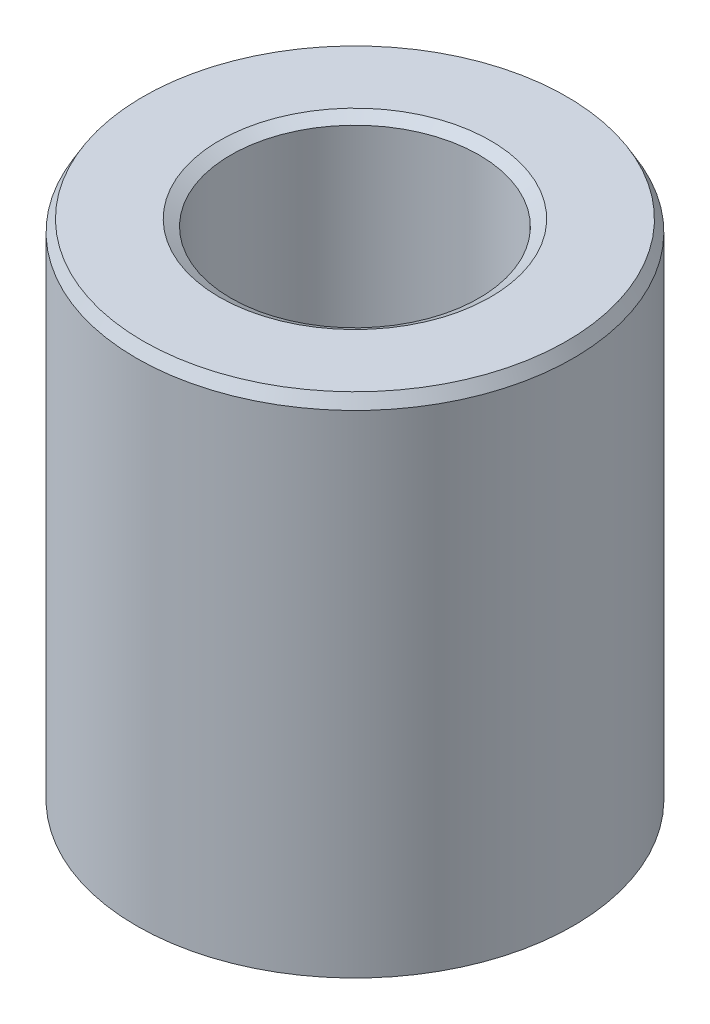
ISO-10303-21;
HEADER;
FILE_DESCRIPTION(('STEP AP214'),'2;1');
FILE_NAME('part.step','',(''),(''),'','','');
FILE_SCHEMA(('AUTOMOTIVE_DESIGN { 1 0 10303 214 1 1 1 1 }'));
ENDSEC;
DATA;
#1=APPLICATION_CONTEXT('core data for automotive mechanical design processes');
#2=APPLICATION_PROTOCOL_DEFINITION('international standard','automotive_design',2000,#1);
#3=PRODUCT_CONTEXT('',#1,'mechanical');
#4=PRODUCT('Part','Part','',(#3));
#5=PRODUCT_RELATED_PRODUCT_CATEGORY('part','',(#4));
#6=PRODUCT_DEFINITION_FORMATION('','',#4);
#7=PRODUCT_DEFINITION_CONTEXT('part definition',#1,'design');
#8=PRODUCT_DEFINITION('design','',#6,#7);
#9=PRODUCT_DEFINITION_SHAPE('','',#8);
#10=(LENGTH_UNIT() NAMED_UNIT(*) SI_UNIT(.MILLI.,.METRE.));
#11=(NAMED_UNIT(*) PLANE_ANGLE_UNIT() SI_UNIT($,.RADIAN.));
#12=(NAMED_UNIT(*) SI_UNIT($,.STERADIAN.) SOLID_ANGLE_UNIT());
#13=UNCERTAINTY_MEASURE_WITH_UNIT(LENGTH_MEASURE(1.E-05),#10,'distance_accuracy_value','');
#14=(GEOMETRIC_REPRESENTATION_CONTEXT(3) GLOBAL_UNCERTAINTY_ASSIGNED_CONTEXT((#13)) GLOBAL_UNIT_ASSIGNED_CONTEXT((#10,
#11,#12)) REPRESENTATION_CONTEXT('',''));
#15=CARTESIAN_POINT('',(0.,0.,0.));
#16=DIRECTION('',(0.,0.,1.));
#17=DIRECTION('',(1.,0.,0.));
#18=AXIS2_PLACEMENT_3D('',#15,#16,#17);
#19=CARTESIAN_POINT('',(0.,122.499252337632,0.));
#20=DIRECTION('',(0.,-1.,0.));
#21=DIRECTION('',(0.,0.,-1.));
#22=AXIS2_PLACEMENT_3D('',#19,#20,#21);
#23=CYLINDRICAL_SURFACE('',#22,52.5);
#24=CARTESIAN_POINT('',(0.,1.59660773206023,0.));
#25=DIRECTION('',(0.,1.,0.));
#26=DIRECTION('',(0.,0.,1.));
#27=AXIS2_PLACEMENT_3D('',#24,#25,#26);
#28=CIRCLE('',#27,52.5);
#29=CARTESIAN_POINT('',(0.,1.59660773206023,52.5));
#30=VERTEX_POINT('',#29);
#31=EDGE_CURVE('E10',#30,#30,#28,.T.);
#32=ORIENTED_EDGE('',*,*,#31,.T.);
#33=EDGE_LOOP('',(#32));
#34=FACE_BOUND('',#33,.T.);
#35=CARTESIAN_POINT('',(0.,119.733846625946,0.));
#36=DIRECTION('',(0.,1.,0.));
#37=DIRECTION('',(0.,0.,1.));
#38=AXIS2_PLACEMENT_3D('',#35,#36,#37);
#39=CIRCLE('',#38,52.5);
#40=CARTESIAN_POINT('',(0.,119.733846625946,52.5));
#41=VERTEX_POINT('',#40);
#42=EDGE_CURVE('E50',#41,#41,#39,.F.);
#43=ORIENTED_EDGE('',*,*,#42,.T.);
#44=EDGE_LOOP('',(#43));
#45=FACE_BOUND('',#44,.T.);
#46=ADVANCED_FACE('F39',(#34,#45),#23,.T.);
#47=CARTESIAN_POINT('',(0.,122.499252337632,0.));
#48=DIRECTION('',(0.,1.,0.));
#49=DIRECTION('',(0.,0.,1.));
#50=AXIS2_PLACEMENT_3D('',#47,#48,#49);
#51=PLANE('',#50);
#52=CARTESIAN_POINT('',(0.,122.499252337632,0.));
#53=DIRECTION('',(0.,1.,0.));
#54=DIRECTION('',(0.,0.,1.));
#55=AXIS2_PLACEMENT_3D('',#52,#53,#54);
#56=CIRCLE('',#55,32.5895834762963);
#57=CARTESIAN_POINT('',(0.,122.499252337632,32.5895834762962));
#58=VERTEX_POINT('',#57);
#59=EDGE_CURVE('E58',#58,#58,#56,.F.);
#60=ORIENTED_EDGE('',*,*,#59,.T.);
#61=EDGE_LOOP('',(#60));
#62=FACE_BOUND('',#61,.T.);
#63=CARTESIAN_POINT('',(0.,122.499252337632,0.));
#64=DIRECTION('',(0.,1.,0.));
#65=DIRECTION('',(0.,0.,1.));
#66=AXIS2_PLACEMENT_3D('',#63,#64,#65);
#67=CIRCLE('',#66,50.9033922679398);
#68=CARTESIAN_POINT('',(0.,122.499252337632,50.9033922679398));
#69=VERTEX_POINT('',#68);
#70=EDGE_CURVE('E61',#69,#69,#67,.T.);
#71=ORIENTED_EDGE('',*,*,#70,.T.);
#72=EDGE_LOOP('',(#71));
#73=FACE_BOUND('',#72,.T.);
#74=ADVANCED_FACE('F88',(#62,#73),#51,.T.);
#75=CARTESIAN_POINT('',(0.,0.,0.));
#76=DIRECTION('',(0.,1.,0.));
#77=DIRECTION('',(0.,0.,1.));
#78=AXIS2_PLACEMENT_3D('',#75,#76,#77);
#79=PLANE('',#78);
#80=CARTESIAN_POINT('',(0.,0.,0.));
#81=DIRECTION('',(0.,1.,0.));
#82=DIRECTION('',(0.,0.,1.));
#83=AXIS2_PLACEMENT_3D('',#80,#81,#82);
#84=CIRCLE('',#83,31.4207854966708);
#85=CARTESIAN_POINT('',(0.,0.,31.4207854966708));
#86=VERTEX_POINT('',#85);
#87=EDGE_CURVE('E51',#86,#86,#84,.T.);
#88=ORIENTED_EDGE('',*,*,#87,.T.);
#89=EDGE_LOOP('',(#88));
#90=FACE_BOUND('',#89,.T.);
#91=CARTESIAN_POINT('',(0.,0.,0.));
#92=DIRECTION('',(0.,1.,0.));
#93=DIRECTION('',(0.,0.,1.));
#94=AXIS2_PLACEMENT_3D('',#91,#92,#93);
#95=CIRCLE('',#94,49.7345942883143);
#96=CARTESIAN_POINT('',(0.,0.,49.7345942883143));
#97=VERTEX_POINT('',#96);
#98=EDGE_CURVE('E54',#97,#97,#95,.F.);
#99=ORIENTED_EDGE('',*,*,#98,.T.);
#100=EDGE_LOOP('',(#99));
#101=FACE_BOUND('',#100,.T.);
#102=ADVANCED_FACE('F83',(#90,#101),#79,.F.);
#103=CARTESIAN_POINT('',(0.,122.499252337632,0.));
#104=DIRECTION('',(0.,-1.,0.));
#105=DIRECTION('',(0.,0.,-1.));
#106=AXIS2_PLACEMENT_3D('',#103,#104,#105);
#107=CYLINDRICAL_SURFACE('',#106,29.8241777646106);
#108=CARTESIAN_POINT('',(0.,120.902644605571,0.));
#109=DIRECTION('',(0.,1.,0.));
#110=DIRECTION('',(0.,0.,1.));
#111=AXIS2_PLACEMENT_3D('',#108,#109,#110);
#112=CIRCLE('',#111,29.8241777646106);
#113=CARTESIAN_POINT('',(0.,120.902644605571,29.8241777646106));
#114=VERTEX_POINT('',#113);
#115=EDGE_CURVE('E67',#114,#114,#112,.T.);
#116=ORIENTED_EDGE('',*,*,#115,.T.);
#117=EDGE_LOOP('',(#116));
#118=FACE_BOUND('',#117,.T.);
#119=CARTESIAN_POINT('',(0.,2.76540571168568,0.));
#120=DIRECTION('',(0.,1.,0.));
#121=DIRECTION('',(0.,0.,1.));
#122=AXIS2_PLACEMENT_3D('',#119,#120,#121);
#123=CIRCLE('',#122,29.8241777646106);
#124=CARTESIAN_POINT('',(0.,2.76540571168568,29.8241777646106));
#125=VERTEX_POINT('',#124);
#126=EDGE_CURVE('E69',#125,#125,#123,.F.);
#127=ORIENTED_EDGE('',*,*,#126,.T.);
#128=EDGE_LOOP('',(#127));
#129=FACE_BOUND('',#128,.T.);
#130=ADVANCED_FACE('F71',(#118,#129),#107,.F.);
#131=CARTESIAN_POINT('',(0.,120.902644605571,0.));
#132=DIRECTION('',(0.,1.,0.));
#133=DIRECTION('',(0.,0.,1.));
#134=AXIS2_PLACEMENT_3D('',#131,#132,#133);
#135=CONICAL_SURFACE('',#134,29.8241777646106,1.0471975511966);
#136=CARTESIAN_POINT('',(0.,122.499252337632,32.5895834762962));
#137=CARTESIAN_POINT('',(0.,122.482621007089,32.5607771667995));
#138=CARTESIAN_POINT('',(0.,122.465989676547,32.5319708573028));
#139=CARTESIAN_POINT('',(0.,122.432727015463,32.4743582383093));
#140=CARTESIAN_POINT('',(0.,122.41609568492,32.4455519288126));
#141=CARTESIAN_POINT('',(0.,122.382833023836,32.3879393098192));
#142=CARTESIAN_POINT('',(0.,122.366201693293,32.3591330003224));
#143=CARTESIAN_POINT('',(0.,122.332939032209,32.301520381329));
#144=CARTESIAN_POINT('',(0.,122.316307701666,32.2727140718323));
#145=CARTESIAN_POINT('',(0.,122.283045040582,32.2151014528388));
#146=CARTESIAN_POINT('',(0.,122.26641371004,32.1862951433421));
#147=CARTESIAN_POINT('',(0.,122.233151048955,32.1286825243486));
#148=CARTESIAN_POINT('',(0.,122.216519718413,32.0998762148519));
#149=CARTESIAN_POINT('',(0.,122.183257057328,32.0422635958585));
#150=CARTESIAN_POINT('',(0.,122.166625726786,32.0134572863617));
#151=CARTESIAN_POINT('',(0.,122.133363065701,31.9558446673683));
#152=CARTESIAN_POINT('',(0.,122.116731735159,31.9270383578716));
#153=CARTESIAN_POINT('',(0.,122.083469074074,31.8694257388781));
#154=CARTESIAN_POINT('',(0.,122.066837743532,31.8406194293814));
#155=CARTESIAN_POINT('',(0.,122.033575082447,31.7830068103879));
#156=CARTESIAN_POINT('',(0.,122.016943751905,31.7542005008912));
#157=CARTESIAN_POINT('',(0.,121.983681090821,31.6965878818977));
#158=CARTESIAN_POINT('',(0.,121.967049760278,31.667781572401));
#159=CARTESIAN_POINT('',(0.,121.933787099194,31.6101689534076));
#160=CARTESIAN_POINT('',(0.,121.917155768651,31.5813626439109));
#161=CARTESIAN_POINT('',(0.,121.883893107567,31.5237500249174));
#162=CARTESIAN_POINT('',(0.,121.867261777025,31.4949437154207));
#163=CARTESIAN_POINT('',(0.,121.83399911594,31.4373310964272));
#164=CARTESIAN_POINT('',(0.,121.817367785398,31.4085247869305));
#165=CARTESIAN_POINT('',(0.,121.784105124313,31.350912167937));
#166=CARTESIAN_POINT('',(0.,121.767473793771,31.3221058584403));
#167=CARTESIAN_POINT('',(0.,121.734211132686,31.2644932394469));
#168=CARTESIAN_POINT('',(0.,121.717579802144,31.2356869299501));
#169=CARTESIAN_POINT('',(0.,121.684317141059,31.1780743109567));
#170=CARTESIAN_POINT('',(0.,121.667685810517,31.14926800146));
#171=CARTESIAN_POINT('',(0.,121.634423149432,31.0916553824665));
#172=CARTESIAN_POINT('',(0.,121.61779181889,31.0628490729698));
#173=CARTESIAN_POINT('',(0.,121.584529157806,31.0052364539763));
#174=CARTESIAN_POINT('',(0.,121.567897827263,30.9764301444796));
#175=CARTESIAN_POINT('',(0.,121.534635166179,30.9188175254862));
#176=CARTESIAN_POINT('',(0.,121.518003835636,30.8900112159894));
#177=CARTESIAN_POINT('',(0.,121.484741174552,30.832398596996));
#178=CARTESIAN_POINT('',(0.,121.468109844009,30.8035922874993));
#179=CARTESIAN_POINT('',(0.,121.434847182925,30.7459796685058));
#180=CARTESIAN_POINT('',(0.,121.418215852383,30.7171733590091));
#181=CARTESIAN_POINT('',(0.,121.384953191298,30.6595607400156));
#182=CARTESIAN_POINT('',(0.,121.368321860756,30.6307544305189));
#183=CARTESIAN_POINT('',(0.,121.335059199671,30.5731418115254));
#184=CARTESIAN_POINT('',(0.,121.318427869129,30.5443355020287));
#185=CARTESIAN_POINT('',(0.,121.285165208044,30.4867228830353));
#186=CARTESIAN_POINT('',(0.,121.268533877502,30.4579165735385));
#187=CARTESIAN_POINT('',(0.,121.235271216417,30.4003039545451));
#188=CARTESIAN_POINT('',(0.,121.218639885875,30.3714976450484));
#189=CARTESIAN_POINT('',(0.,121.18537722479,30.3138850260549));
#190=CARTESIAN_POINT('',(0.,121.168745894248,30.2850787165582));
#191=CARTESIAN_POINT('',(0.,121.135483233164,30.2274660975647));
#192=CARTESIAN_POINT('',(0.,121.118851902621,30.198659788068));
#193=CARTESIAN_POINT('',(0.,121.085589241537,30.1410471690746));
#194=CARTESIAN_POINT('',(0.,121.068957910994,30.1122408595778));
#195=CARTESIAN_POINT('',(0.,121.03569524991,30.0546282405844));
#196=CARTESIAN_POINT('',(0.,121.019063919368,30.0258219310877));
#197=CARTESIAN_POINT('',(0.,120.985801258283,29.9682093120942));
#198=CARTESIAN_POINT('',(0.,120.969169927741,29.9394030025975));
#199=CARTESIAN_POINT('',(0.,120.935907266656,29.881790383604));
#200=CARTESIAN_POINT('',(0.,120.919275936114,29.8529840741073));
#201=CARTESIAN_POINT('',(0.,120.902644605571,29.8241777646106));
#202=B_SPLINE_CURVE_WITH_KNOTS('',3,(#136,#137,#138,#139,#140,#141,#142,#143,#144,#145,#146,
#147,#148,#149,#150,#151,#152,#153,#154,#155,#156,#157,#158,#159,#160,#161,#162,#163,#164,#165,
#166,#167,#168,#169,#170,#171,#172,#173,#174,#175,#176,#177,#178,#179,#180,#181,#182,#183,#184,
#185,#186,#187,#188,#189,#190,#191,#192,#193,#194,#195,#196,#197,#198,#199,#200,#201),
.UNSPECIFIED.,.F.,.F.,(4,2,2,2,2,2,2,2,2,2,2,2,2,2,2,2,2,2,2,2,2,2,2,2,2,2,2,2,2,2,2,2,4),(0.,
0.0997879832537688,0.199575966507532,0.299363949761293,0.399151933015062,0.498939916268831,
0.598727899522593,0.698515882776356,0.798303866030125,0.898091849283886,0.997879832537655,
1.09766781579142,1.19745579904518,1.29724378229895,1.39703176555272,1.49681974880648,
1.59660773206025,1.69639571531401,1.79618369856778,1.89597168182154,1.99575966507531,
2.09554764832907,2.19533563158284,2.29512361483661,2.39491159809037,2.49469958134413,
2.5944875645979,2.69427554785166,2.79406353110543,2.8938515143592,2.99363949761296,
3.09342748086673,3.19321546412049),.UNSPECIFIED.);
#203=EDGE_CURVE('BSEAM77',#58,#114,#202,.T.);
#204=ORIENTED_EDGE('',*,*,#59,.F.);
#205=ORIENTED_EDGE('',*,*,#115,.F.);
#206=ORIENTED_EDGE('',*,*,#203,.T.);
#207=ORIENTED_EDGE('',*,*,#203,.F.);
#208=EDGE_LOOP('',(#204,#206,#205,#207));
#209=FACE_BOUND('',#208,.T.);
#210=ADVANCED_FACE('F77',(#209),#135,.F.);
#211=CARTESIAN_POINT('',(0.,0.,0.));
#212=DIRECTION('',(0.,-1.,0.));
#213=DIRECTION('',(0.,0.,-1.));
#214=AXIS2_PLACEMENT_3D('',#211,#212,#213);
#215=CONICAL_SURFACE('',#214,31.4207854966708,0.523598775598292);
#216=ORIENTED_EDGE('',*,*,#126,.F.);
#217=EDGE_LOOP('',(#216));
#218=FACE_BOUND('',#217,.T.);
#219=ORIENTED_EDGE('',*,*,#87,.F.);
#220=EDGE_LOOP('',(#219));
#221=FACE_BOUND('',#220,.T.);
#222=ADVANCED_FACE('F73',(#218,#221),#215,.F.);
#223=CARTESIAN_POINT('',(0.,1.59660773206023,0.));
#224=DIRECTION('',(0.,1.,0.));
#225=DIRECTION('',(0.,0.,1.));
#226=AXIS2_PLACEMENT_3D('',#223,#224,#225);
#227=CONICAL_SURFACE('',#226,52.5,1.0471975511966);
#228=CARTESIAN_POINT('',(0.,0.,49.7345942883143));
#229=CARTESIAN_POINT('',(0.,0.0166313305422924,49.7634005978111));
#230=CARTESIAN_POINT('',(0.,0.033262661084587,49.7922069073078));
#231=CARTESIAN_POINT('',(0.,0.0665253221691761,49.8498195263012));
#232=CARTESIAN_POINT('',(0.,0.0831566527114706,49.878625835798));
#233=CARTESIAN_POINT('',(0.,0.116419313796059,49.9362384547914));
#234=CARTESIAN_POINT('',(0.,0.133050644338353,49.9650447642881));
#235=CARTESIAN_POINT('',(0.,0.16631330542294,50.0226573832816));
#236=CARTESIAN_POINT('',(0.,0.182944635965235,50.0514636927783));
#237=CARTESIAN_POINT('',(0.,0.216207297049823,50.1090763117718));
#238=CARTESIAN_POINT('',(0.,0.232838627592117,50.1378826212685));
#239=CARTESIAN_POINT('',(0.,0.266101288676705,50.1954952402619));
#240=CARTESIAN_POINT('',(0.,0.282732619218999,50.2243015497587));
#241=CARTESIAN_POINT('',(0.,0.315995280303587,50.2819141687521));
#242=CARTESIAN_POINT('',(0.,0.332626610845882,50.3107204782488));
#243=CARTESIAN_POINT('',(0.,0.36588927193047,50.3683330972423));
#244=CARTESIAN_POINT('',(0.,0.382520602472764,50.397139406739));
#245=CARTESIAN_POINT('',(0.,0.415783263557352,50.4547520257325));
#246=CARTESIAN_POINT('',(0.,0.432414594099646,50.4835583352292));
#247=CARTESIAN_POINT('',(0.,0.465677255184234,50.5411709542227));
#248=CARTESIAN_POINT('',(0.,0.482308585726528,50.5699772637194));
#249=CARTESIAN_POINT('',(0.,0.515571246811116,50.6275898827128));
#250=CARTESIAN_POINT('',(0.,0.532202577353411,50.6563961922096));
#251=CARTESIAN_POINT('',(0.,0.565465238437999,50.714008811203));
#252=CARTESIAN_POINT('',(0.,0.582096568980293,50.7428151206997));
#253=CARTESIAN_POINT('',(0.,0.615359230064881,50.8004277396932));
#254=CARTESIAN_POINT('',(0.,0.631990560607175,50.8292340491899));
#255=CARTESIAN_POINT('',(0.,0.665253221691763,50.8868466681834));
#256=CARTESIAN_POINT('',(0.,0.681884552234057,50.9156529776801));
#257=CARTESIAN_POINT('',(0.,0.715147213318645,50.9732655966735));
#258=CARTESIAN_POINT('',(0.,0.731778543860939,51.0020719061703));
#259=CARTESIAN_POINT('',(0.,0.765041204945527,51.0596845251637));
#260=CARTESIAN_POINT('',(0.,0.781672535487822,51.0884908346604));
#261=CARTESIAN_POINT('',(0.,0.81493519657241,51.1461034536539));
#262=CARTESIAN_POINT('',(0.,0.831566527114704,51.1749097631506));
#263=CARTESIAN_POINT('',(0.,0.864829188199292,51.2325223821441));
#264=CARTESIAN_POINT('',(0.,0.881460518741586,51.2613286916408));
#265=CARTESIAN_POINT('',(0.,0.914723179826174,51.3189413106342));
#266=CARTESIAN_POINT('',(0.,0.931354510368468,51.347747620131));
#267=CARTESIAN_POINT('',(0.,0.964617171453056,51.4053602391244));
#268=CARTESIAN_POINT('',(0.,0.98124850199535,51.4341665486211));
#269=CARTESIAN_POINT('',(0.,1.01451116307994,51.4917791676146));
#270=CARTESIAN_POINT('',(0.,1.03114249362223,51.5205854771113));
#271=CARTESIAN_POINT('',(0.,1.06440515470682,51.5781980961048));
#272=CARTESIAN_POINT('',(0.,1.08103648524912,51.6070044056015));
#273=CARTESIAN_POINT('',(0.,1.1142991463337,51.664617024595));
#274=CARTESIAN_POINT('',(0.,1.130930476876,51.6934233340917));
#275=CARTESIAN_POINT('',(0.,1.16419313796059,51.7510359530851));
#276=CARTESIAN_POINT('',(0.,1.18082446850288,51.7798422625819));
#277=CARTESIAN_POINT('',(0.,1.21408712958747,51.8374548815753));
#278=CARTESIAN_POINT('',(0.,1.23071846012976,51.866261191072));
#279=CARTESIAN_POINT('',(0.,1.26398112121435,51.9238738100655));
#280=CARTESIAN_POINT('',(0.,1.28061245175664,51.9526801195622));
#281=CARTESIAN_POINT('',(0.,1.31387511284123,52.0102927385557));
#282=CARTESIAN_POINT('',(0.,1.33050644338353,52.0390990480524));
#283=CARTESIAN_POINT('',(0.,1.36376910446811,52.0967116670458));
#284=CARTESIAN_POINT('',(0.,1.38040043501041,52.1255179765426));
#285=CARTESIAN_POINT('',(0.,1.413663096095,52.183130595536));
#286=CARTESIAN_POINT('',(0.,1.43029442663729,52.2119369050327));
#287=CARTESIAN_POINT('',(0.,1.46355708772188,52.2695495240262));
#288=CARTESIAN_POINT('',(0.,1.48018841826417,52.2983558335229));
#289=CARTESIAN_POINT('',(0.,1.51345107934876,52.3559684525164));
#290=CARTESIAN_POINT('',(0.,1.53008240989106,52.3847747620131));
#291=CARTESIAN_POINT('',(0.,1.56334507097564,52.4423873810065));
#292=CARTESIAN_POINT('',(0.,1.57997640151794,52.4711936905033));
#293=CARTESIAN_POINT('',(0.,1.59660773206023,52.5));
#294=B_SPLINE_CURVE_WITH_KNOTS('',3,(#228,#229,#230,#231,#232,#233,#234,#235,#236,#237,#238,
#239,#240,#241,#242,#243,#244,#245,#246,#247,#248,#249,#250,#251,#252,#253,#254,#255,#256,#257,
#258,#259,#260,#261,#262,#263,#264,#265,#266,#267,#268,#269,#270,#271,#272,#273,#274,#275,#276,
#277,#278,#279,#280,#281,#282,#283,#284,#285,#286,#287,#288,#289,#290,#291,#292,#293),
.UNSPECIFIED.,.F.,.F.,(4,2,2,2,2,2,2,2,2,2,2,2,2,2,2,2,2,2,2,2,2,2,2,2,2,2,2,2,2,2,2,2,4),(0.,
0.0997879832537664,0.199575966507527,0.299363949761293,0.39915193301506,0.498939916268826,
0.598727899522592,0.698515882776353,0.798303866030119,0.898091849283886,0.997879832537652,
1.09766781579141,1.19745579904518,1.29724378229895,1.39703176555271,1.49681974880648,
1.59660773206024,1.69639571531401,1.79618369856777,1.89597168182154,1.9957596650753,
2.09554764832906,2.19533563158283,2.2951236148366,2.39491159809036,2.49469958134412,
2.59448756459789,2.69427554785166,2.79406353110542,2.89385151435919,2.99363949761295,
3.09342748086672,3.19321546412048),.UNSPECIFIED.);
#295=EDGE_CURVE('BSEAM76',#97,#30,#294,.T.);
#296=ORIENTED_EDGE('',*,*,#98,.F.);
#297=ORIENTED_EDGE('',*,*,#31,.F.);
#298=ORIENTED_EDGE('',*,*,#295,.T.);
#299=ORIENTED_EDGE('',*,*,#295,.F.);
#300=EDGE_LOOP('',(#296,#298,#297,#299));
#301=FACE_BOUND('',#300,.T.);
#302=ADVANCED_FACE('F76',(#301),#227,.T.);
#303=CARTESIAN_POINT('',(0.,122.499252337632,0.));
#304=DIRECTION('',(0.,-1.,0.));
#305=DIRECTION('',(0.,0.,-1.));
#306=AXIS2_PLACEMENT_3D('',#303,#304,#305);
#307=CONICAL_SURFACE('',#306,50.9033922679398,0.523598775598302);
#308=ORIENTED_EDGE('',*,*,#42,.F.);
#309=EDGE_LOOP('',(#308));
#310=FACE_BOUND('',#309,.T.);
#311=ORIENTED_EDGE('',*,*,#70,.F.);
#312=EDGE_LOOP('',(#311));
#313=FACE_BOUND('',#312,.T.);
#314=ADVANCED_FACE('F45',(#310,#313),#307,.T.);
#315=CLOSED_SHELL('',(#46,#74,#102,#130,#210,#222,#302,#314));
#316=MANIFOLD_SOLID_BREP('B2',#315);
#317=ADVANCED_BREP_SHAPE_REPRESENTATION('',(#18,#316),#14);
#318=SHAPE_DEFINITION_REPRESENTATION(#9,#317);
ENDSEC;
END-ISO-10303-21;
